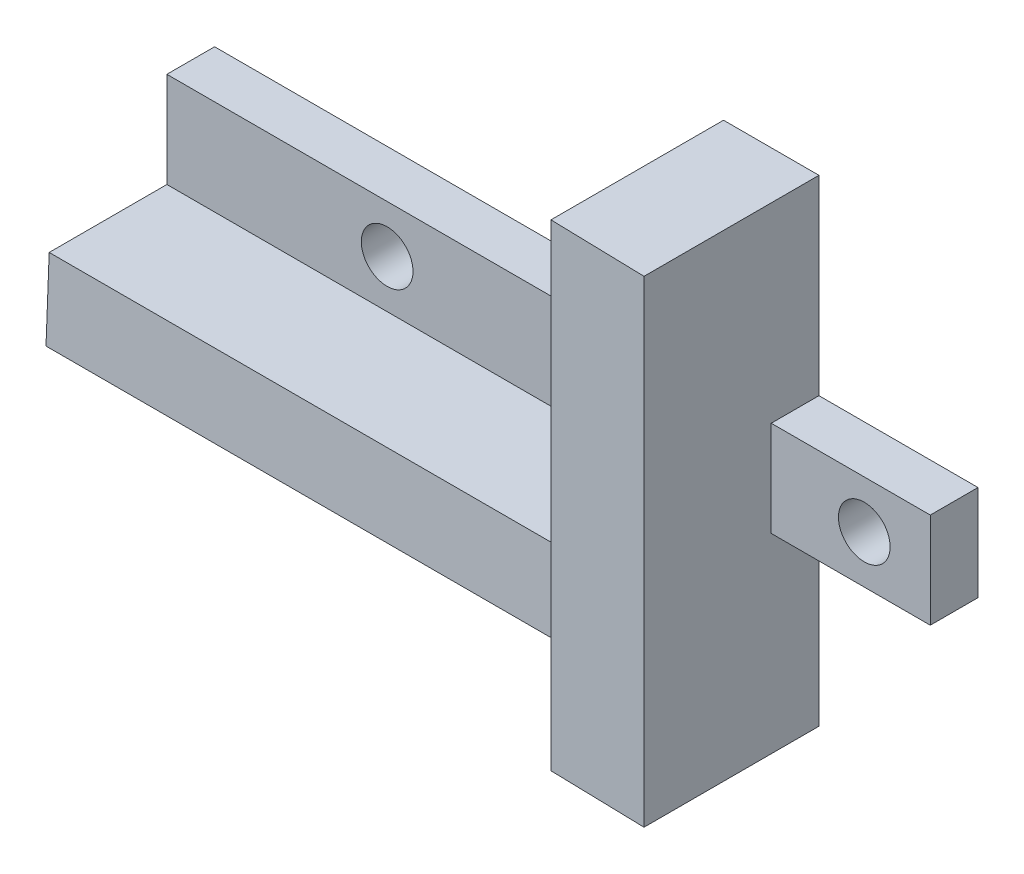
ISO-10303-21;
HEADER;
FILE_DESCRIPTION(('STEP AP214'),'2;1');
FILE_NAME('part.step','',(''),(''),'','','');
FILE_SCHEMA(('AUTOMOTIVE_DESIGN { 1 0 10303 214 1 1 1 1 }'));
ENDSEC;
DATA;
#1=APPLICATION_CONTEXT('core data for automotive mechanical design processes');
#2=APPLICATION_PROTOCOL_DEFINITION('international standard','automotive_design',2000,#1);
#3=PRODUCT_CONTEXT('',#1,'mechanical');
#4=PRODUCT('Part','Part','',(#3));
#5=PRODUCT_RELATED_PRODUCT_CATEGORY('part','',(#4));
#6=PRODUCT_DEFINITION_FORMATION('','',#4);
#7=PRODUCT_DEFINITION_CONTEXT('part definition',#1,'design');
#8=PRODUCT_DEFINITION('design','',#6,#7);
#9=PRODUCT_DEFINITION_SHAPE('','',#8);
#10=(LENGTH_UNIT() NAMED_UNIT(*) SI_UNIT(.MILLI.,.METRE.));
#11=(NAMED_UNIT(*) PLANE_ANGLE_UNIT() SI_UNIT($,.RADIAN.));
#12=(NAMED_UNIT(*) SI_UNIT($,.STERADIAN.) SOLID_ANGLE_UNIT());
#13=UNCERTAINTY_MEASURE_WITH_UNIT(LENGTH_MEASURE(1.E-05),#10,'distance_accuracy_value','');
#14=(GEOMETRIC_REPRESENTATION_CONTEXT(3) GLOBAL_UNCERTAINTY_ASSIGNED_CONTEXT((#13)) GLOBAL_UNIT_ASSIGNED_CONTEXT((#10,
#11,#12)) REPRESENTATION_CONTEXT('',''));
#15=CARTESIAN_POINT('',(0.,0.,0.));
#16=DIRECTION('',(0.,0.,1.));
#17=DIRECTION('',(1.,0.,0.));
#18=AXIS2_PLACEMENT_3D('',#15,#16,#17);
#19=CARTESIAN_POINT('',(0.,0.,3.));
#20=DIRECTION('',(0.,0.,1.));
#21=DIRECTION('',(1.,0.,0.));
#22=AXIS2_PLACEMENT_3D('',#19,#20,#21);
#23=PLANE('',#22);
#24=DIRECTION('',(0.,1.,0.));
#25=VECTOR('',#24,1.);
#26=CARTESIAN_POINT('',(38.,0.,3.));
#27=LINE('',#26,#25);
#28=CARTESIAN_POINT('',(38.,-6.,3.));
#29=VERTEX_POINT('',#28);
#30=CARTESIAN_POINT('',(38.,0.,3.));
#31=VERTEX_POINT('',#30);
#32=EDGE_CURVE('E121',#29,#31,#27,.T.);
#33=ORIENTED_EDGE('',*,*,#32,.F.);
#34=DIRECTION('',(1.,0.,0.));
#35=VECTOR('',#34,1.);
#36=CARTESIAN_POINT('',(48.,-6.,3.));
#37=LINE('',#36,#35);
#38=CARTESIAN_POINT('',(48.,-6.,3.));
#39=VERTEX_POINT('',#38);
#40=EDGE_CURVE('E167',#29,#39,#37,.T.);
#41=ORIENTED_EDGE('',*,*,#40,.T.);
#42=DIRECTION('',(0.,1.,0.));
#43=VECTOR('',#42,1.);
#44=CARTESIAN_POINT('',(48.,0.,3.));
#45=LINE('',#44,#43);
#46=CARTESIAN_POINT('',(48.,0.,3.));
#47=VERTEX_POINT('',#46);
#48=EDGE_CURVE('E124',#39,#47,#45,.T.);
#49=ORIENTED_EDGE('',*,*,#48,.T.);
#50=DIRECTION('',(-1.,0.,0.));
#51=VECTOR('',#50,1.);
#52=CARTESIAN_POINT('',(48.,0.,3.));
#53=LINE('',#52,#51);
#54=EDGE_CURVE('E117',#47,#31,#53,.T.);
#55=ORIENTED_EDGE('',*,*,#54,.T.);
#56=EDGE_LOOP('',(#33,#41,#49,#55));
#57=FACE_BOUND('',#56,.T.);
#58=CARTESIAN_POINT('',(43.85,-3.,3.));
#59=DIRECTION('',(0.,0.,1.));
#60=DIRECTION('',(1.,0.,0.));
#61=AXIS2_PLACEMENT_3D('',#58,#59,#60);
#62=CIRCLE('',#61,1.625);
#63=CARTESIAN_POINT('',(45.475,-3.,3.));
#64=VERTEX_POINT('',#63);
#65=EDGE_CURVE('E145',#64,#64,#62,.T.);
#66=ORIENTED_EDGE('',*,*,#65,.F.);
#67=EDGE_LOOP('',(#66));
#68=FACE_BOUND('',#67,.T.);
#69=ADVANCED_FACE('F32',(#57,#68),#23,.T.);
#70=CARTESIAN_POINT('',(0.,0.,3.));
#71=DIRECTION('',(1.,0.,0.));
#72=DIRECTION('',(0.,0.,-1.));
#73=AXIS2_PLACEMENT_3D('',#70,#71,#72);
#74=PLANE('',#73);
#75=DIRECTION('',(0.,0.,1.));
#76=VECTOR('',#75,1.);
#77=CARTESIAN_POINT('',(0.,-11.,0.));
#78=LINE('',#77,#76);
#79=CARTESIAN_POINT('',(0.,-11.,0.));
#80=VERTEX_POINT('',#79);
#81=CARTESIAN_POINT('',(0.,-11.,10.6));
#82=VERTEX_POINT('',#81);
#83=EDGE_CURVE('E263',#80,#82,#78,.T.);
#84=ORIENTED_EDGE('',*,*,#83,.T.);
#85=DIRECTION('',(0.,-0.999200958721789,0.0399680383488716));
#86=VECTOR('',#85,1.);
#87=CARTESIAN_POINT('',(0.,-11.,10.6));
#88=LINE('',#87,#86);
#89=CARTESIAN_POINT('',(0.,-6.,10.4));
#90=VERTEX_POINT('',#89);
#91=EDGE_CURVE('E247',#90,#82,#88,.T.);
#92=ORIENTED_EDGE('',*,*,#91,.F.);
#93=DIRECTION('',(0.,0.,1.));
#94=VECTOR('',#93,1.);
#95=CARTESIAN_POINT('',(0.,-6.,0.));
#96=LINE('',#95,#94);
#97=CARTESIAN_POINT('',(0.,-6.,3.));
#98=VERTEX_POINT('',#97);
#99=EDGE_CURVE('E266',#98,#90,#96,.T.);
#100=ORIENTED_EDGE('',*,*,#99,.F.);
#101=DIRECTION('',(0.,-1.,0.));
#102=VECTOR('',#101,1.);
#103=CARTESIAN_POINT('',(0.,0.,3.));
#104=LINE('',#103,#102);
#105=CARTESIAN_POINT('',(0.,0.,3.));
#106=VERTEX_POINT('',#105);
#107=EDGE_CURVE('E100',#106,#98,#104,.T.);
#108=ORIENTED_EDGE('',*,*,#107,.F.);
#109=DIRECTION('',(0.,0.,-1.));
#110=VECTOR('',#109,1.);
#111=CARTESIAN_POINT('',(0.,0.,3.));
#112=LINE('',#111,#110);
#113=CARTESIAN_POINT('',(0.,0.,0.));
#114=VERTEX_POINT('',#113);
#115=EDGE_CURVE('E171',#106,#114,#112,.T.);
#116=ORIENTED_EDGE('',*,*,#115,.T.);
#117=DIRECTION('',(0.,-1.,0.));
#118=VECTOR('',#117,1.);
#119=CARTESIAN_POINT('',(0.,0.,0.));
#120=LINE('',#119,#118);
#121=EDGE_CURVE('E158',#114,#80,#120,.T.);
#122=ORIENTED_EDGE('',*,*,#121,.T.);
#123=EDGE_LOOP('',(#84,#92,#100,#108,#116,#122));
#124=FACE_BOUND('',#123,.T.);
#125=ADVANCED_FACE('F34',(#124),#74,.F.);
#126=CARTESIAN_POINT('',(32.,-18.,3.));
#127=DIRECTION('',(0.,1.,0.));
#128=DIRECTION('',(0.,0.,1.));
#129=AXIS2_PLACEMENT_3D('',#126,#127,#128);
#130=PLANE('',#129);
#131=DIRECTION('',(0.,0.,-1.));
#132=VECTOR('',#131,1.);
#133=CARTESIAN_POINT('',(38.,-18.,3.));
#134=LINE('',#133,#132);
#135=CARTESIAN_POINT('',(38.,-18.,11.));
#136=VERTEX_POINT('',#135);
#137=CARTESIAN_POINT('',(38.,-18.,0.));
#138=VERTEX_POINT('',#137);
#139=EDGE_CURVE('E40',#136,#138,#134,.T.);
#140=ORIENTED_EDGE('',*,*,#139,.F.);
#141=DIRECTION('',(0.999687646408123,0.,0.0249921911602032));
#142=VECTOR('',#141,1.);
#143=CARTESIAN_POINT('',(32.,-18.,10.85));
#144=LINE('',#143,#142);
#145=CARTESIAN_POINT('',(32.,-18.,10.85));
#146=VERTEX_POINT('',#145);
#147=EDGE_CURVE('E240',#146,#136,#144,.T.);
#148=ORIENTED_EDGE('',*,*,#147,.F.);
#149=DIRECTION('',(0.,0.,-1.));
#150=VECTOR('',#149,1.);
#151=CARTESIAN_POINT('',(32.,-18.,3.));
#152=LINE('',#151,#150);
#153=CARTESIAN_POINT('',(32.,-18.,0.));
#154=VERTEX_POINT('',#153);
#155=EDGE_CURVE('E11',#146,#154,#152,.T.);
#156=ORIENTED_EDGE('',*,*,#155,.T.);
#157=DIRECTION('',(1.,0.,0.));
#158=VECTOR('',#157,1.);
#159=CARTESIAN_POINT('',(32.,-18.,0.));
#160=LINE('',#159,#158);
#161=EDGE_CURVE('E176',#154,#138,#160,.T.);
#162=ORIENTED_EDGE('',*,*,#161,.T.);
#163=EDGE_LOOP('',(#140,#148,#156,#162));
#164=FACE_BOUND('',#163,.T.);
#165=ADVANCED_FACE('F213',(#164),#130,.F.);
#166=CARTESIAN_POINT('',(48.,-6.,3.));
#167=DIRECTION('',(0.,1.,0.));
#168=DIRECTION('',(-1.,0.,0.));
#169=AXIS2_PLACEMENT_3D('',#166,#167,#168);
#170=PLANE('',#169);
#171=DIRECTION('',(1.,0.,0.));
#172=VECTOR('',#171,1.);
#173=CARTESIAN_POINT('',(48.,-6.,0.));
#174=LINE('',#173,#172);
#175=CARTESIAN_POINT('',(38.,-6.,0.));
#176=VERTEX_POINT('',#175);
#177=CARTESIAN_POINT('',(48.,-6.,0.));
#178=VERTEX_POINT('',#177);
#179=EDGE_CURVE('E181',#176,#178,#174,.T.);
#180=ORIENTED_EDGE('',*,*,#179,.T.);
#181=DIRECTION('',(0.,0.,-1.));
#182=VECTOR('',#181,1.);
#183=CARTESIAN_POINT('',(48.,-6.,3.));
#184=LINE('',#183,#182);
#185=EDGE_CURVE('E201',#39,#178,#184,.T.);
#186=ORIENTED_EDGE('',*,*,#185,.F.);
#187=ORIENTED_EDGE('',*,*,#40,.F.);
#188=DIRECTION('',(0.,0.,-1.));
#189=VECTOR('',#188,1.);
#190=CARTESIAN_POINT('',(38.,-6.,3.));
#191=LINE('',#190,#189);
#192=EDGE_CURVE('E143',#29,#176,#191,.T.);
#193=ORIENTED_EDGE('',*,*,#192,.T.);
#194=EDGE_LOOP('',(#180,#186,#187,#193));
#195=FACE_BOUND('',#194,.T.);
#196=ADVANCED_FACE('F222',(#195),#170,.F.);
#197=CARTESIAN_POINT('',(48.,0.,3.));
#198=DIRECTION('',(-1.,0.,0.));
#199=DIRECTION('',(0.,0.,1.));
#200=AXIS2_PLACEMENT_3D('',#197,#198,#199);
#201=PLANE('',#200);
#202=DIRECTION('',(0.,1.,0.));
#203=VECTOR('',#202,1.);
#204=CARTESIAN_POINT('',(48.,0.,0.));
#205=LINE('',#204,#203);
#206=CARTESIAN_POINT('',(48.,0.,0.));
#207=VERTEX_POINT('',#206);
#208=EDGE_CURVE('E183',#178,#207,#205,.T.);
#209=ORIENTED_EDGE('',*,*,#208,.T.);
#210=DIRECTION('',(0.,0.,-1.));
#211=VECTOR('',#210,1.);
#212=CARTESIAN_POINT('',(48.,0.,3.));
#213=LINE('',#212,#211);
#214=EDGE_CURVE('E137',#47,#207,#213,.T.);
#215=ORIENTED_EDGE('',*,*,#214,.F.);
#216=ORIENTED_EDGE('',*,*,#48,.F.);
#217=ORIENTED_EDGE('',*,*,#185,.T.);
#218=EDGE_LOOP('',(#209,#215,#216,#217));
#219=FACE_BOUND('',#218,.T.);
#220=ADVANCED_FACE('F224',(#219),#201,.F.);
#221=CARTESIAN_POINT('',(48.,0.,3.));
#222=DIRECTION('',(0.,-1.,0.));
#223=DIRECTION('',(1.,0.,0.));
#224=AXIS2_PLACEMENT_3D('',#221,#222,#223);
#225=PLANE('',#224);
#226=DIRECTION('',(-1.,0.,0.));
#227=VECTOR('',#226,1.);
#228=CARTESIAN_POINT('',(48.,0.,0.));
#229=LINE('',#228,#227);
#230=CARTESIAN_POINT('',(38.,0.,0.));
#231=VERTEX_POINT('',#230);
#232=EDGE_CURVE('E133',#207,#231,#229,.T.);
#233=ORIENTED_EDGE('',*,*,#232,.T.);
#234=DIRECTION('',(0.,0.,-1.));
#235=VECTOR('',#234,1.);
#236=CARTESIAN_POINT('',(38.,0.,3.));
#237=LINE('',#236,#235);
#238=EDGE_CURVE('E130',#31,#231,#237,.T.);
#239=ORIENTED_EDGE('',*,*,#238,.F.);
#240=ORIENTED_EDGE('',*,*,#54,.F.);
#241=ORIENTED_EDGE('',*,*,#214,.T.);
#242=EDGE_LOOP('',(#233,#239,#240,#241));
#243=FACE_BOUND('',#242,.T.);
#244=ADVANCED_FACE('F131',(#243),#225,.F.);
#245=CARTESIAN_POINT('',(38.,12.,3.));
#246=DIRECTION('',(-1.,0.,0.));
#247=DIRECTION('',(0.,0.,1.));
#248=AXIS2_PLACEMENT_3D('',#245,#246,#247);
#249=PLANE('',#248);
#250=DIRECTION('',(0.,0.,-1.));
#251=VECTOR('',#250,1.);
#252=CARTESIAN_POINT('',(38.,12.,3.));
#253=LINE('',#252,#251);
#254=CARTESIAN_POINT('',(38.,12.,11.));
#255=VERTEX_POINT('',#254);
#256=CARTESIAN_POINT('',(38.,12.,0.));
#257=VERTEX_POINT('',#256);
#258=EDGE_CURVE('E138',#255,#257,#253,.T.);
#259=ORIENTED_EDGE('',*,*,#258,.F.);
#260=DIRECTION('',(0.,1.,0.));
#261=VECTOR('',#260,1.);
#262=CARTESIAN_POINT('',(38.,12.,11.));
#263=LINE('',#262,#261);
#264=EDGE_CURVE('E209',#136,#255,#263,.T.);
#265=ORIENTED_EDGE('',*,*,#264,.F.);
#266=ORIENTED_EDGE('',*,*,#139,.T.);
#267=DIRECTION('',(0.,1.,0.));
#268=VECTOR('',#267,1.);
#269=CARTESIAN_POINT('',(38.,-6.,0.));
#270=LINE('',#269,#268);
#271=EDGE_CURVE('E179',#138,#176,#270,.T.);
#272=ORIENTED_EDGE('',*,*,#271,.T.);
#273=ORIENTED_EDGE('',*,*,#192,.F.);
#274=ORIENTED_EDGE('',*,*,#32,.T.);
#275=ORIENTED_EDGE('',*,*,#238,.T.);
#276=DIRECTION('',(0.,1.,0.));
#277=VECTOR('',#276,1.);
#278=CARTESIAN_POINT('',(38.,12.,0.));
#279=LINE('',#278,#277);
#280=EDGE_CURVE('E186',#231,#257,#279,.T.);
#281=ORIENTED_EDGE('',*,*,#280,.T.);
#282=EDGE_LOOP('',(#259,#265,#266,#272,#273,#274,#275,#281));
#283=FACE_BOUND('',#282,.T.);
#284=ADVANCED_FACE('F141',(#283),#249,.F.);
#285=CARTESIAN_POINT('',(32.,12.,3.));
#286=DIRECTION('',(0.,-1.,0.));
#287=DIRECTION('',(1.,0.,0.));
#288=AXIS2_PLACEMENT_3D('',#285,#286,#287);
#289=PLANE('',#288);
#290=DIRECTION('',(0.,0.,-1.));
#291=VECTOR('',#290,1.);
#292=CARTESIAN_POINT('',(32.,12.,3.));
#293=LINE('',#292,#291);
#294=CARTESIAN_POINT('',(32.,12.,10.85));
#295=VERTEX_POINT('',#294);
#296=CARTESIAN_POINT('',(32.,12.,0.));
#297=VERTEX_POINT('',#296);
#298=EDGE_CURVE('E197',#295,#297,#293,.T.);
#299=ORIENTED_EDGE('',*,*,#298,.F.);
#300=DIRECTION('',(0.999687646408123,0.,0.0249921911602032));
#301=VECTOR('',#300,1.);
#302=CARTESIAN_POINT('',(32.,12.,10.85));
#303=LINE('',#302,#301);
#304=EDGE_CURVE('E235',#295,#255,#303,.T.);
#305=ORIENTED_EDGE('',*,*,#304,.T.);
#306=ORIENTED_EDGE('',*,*,#258,.T.);
#307=DIRECTION('',(-1.,0.,0.));
#308=VECTOR('',#307,1.);
#309=CARTESIAN_POINT('',(32.,12.,0.));
#310=LINE('',#309,#308);
#311=EDGE_CURVE('E188',#257,#297,#310,.T.);
#312=ORIENTED_EDGE('',*,*,#311,.T.);
#313=EDGE_LOOP('',(#299,#305,#306,#312));
#314=FACE_BOUND('',#313,.T.);
#315=ADVANCED_FACE('F233',(#314),#289,.F.);
#316=CARTESIAN_POINT('',(32.,12.,3.));
#317=DIRECTION('',(1.,0.,0.));
#318=DIRECTION('',(0.,0.,-1.));
#319=AXIS2_PLACEMENT_3D('',#316,#317,#318);
#320=PLANE('',#319);
#321=ORIENTED_EDGE('',*,*,#155,.F.);
#322=DIRECTION('',(0.,-1.,0.));
#323=VECTOR('',#322,1.);
#324=CARTESIAN_POINT('',(32.,12.,10.85));
#325=LINE('',#324,#323);
#326=EDGE_CURVE('E239',#295,#146,#325,.T.);
#327=ORIENTED_EDGE('',*,*,#326,.F.);
#328=ORIENTED_EDGE('',*,*,#298,.T.);
#329=DIRECTION('',(0.,-1.,0.));
#330=VECTOR('',#329,1.);
#331=CARTESIAN_POINT('',(32.,12.,0.));
#332=LINE('',#331,#330);
#333=CARTESIAN_POINT('',(32.,0.,0.));
#334=VERTEX_POINT('',#333);
#335=EDGE_CURVE('E191',#297,#334,#332,.T.);
#336=ORIENTED_EDGE('',*,*,#335,.T.);
#337=DIRECTION('',(0.,0.,-1.));
#338=VECTOR('',#337,1.);
#339=CARTESIAN_POINT('',(32.,0.,3.));
#340=LINE('',#339,#338);
#341=CARTESIAN_POINT('',(32.,0.,3.));
#342=VERTEX_POINT('',#341);
#343=EDGE_CURVE('E195',#342,#334,#340,.T.);
#344=ORIENTED_EDGE('',*,*,#343,.F.);
#345=DIRECTION('',(0.,-1.,0.));
#346=VECTOR('',#345,1.);
#347=CARTESIAN_POINT('',(32.,0.,3.));
#348=LINE('',#347,#346);
#349=CARTESIAN_POINT('',(32.,-6.,3.));
#350=VERTEX_POINT('',#349);
#351=EDGE_CURVE('E146',#342,#350,#348,.T.);
#352=ORIENTED_EDGE('',*,*,#351,.T.);
#353=DIRECTION('',(0.,0.,1.));
#354=VECTOR('',#353,1.);
#355=CARTESIAN_POINT('',(32.,-6.,0.));
#356=LINE('',#355,#354);
#357=CARTESIAN_POINT('',(32.,-6.,10.4));
#358=VERTEX_POINT('',#357);
#359=EDGE_CURVE('E261',#350,#358,#356,.T.);
#360=ORIENTED_EDGE('',*,*,#359,.T.);
#361=DIRECTION('',(0.,-0.999200958721789,0.0399680383488716));
#362=VECTOR('',#361,1.);
#363=CARTESIAN_POINT('',(32.,-11.,10.6));
#364=LINE('',#363,#362);
#365=CARTESIAN_POINT('',(32.,-11.,10.6));
#366=VERTEX_POINT('',#365);
#367=EDGE_CURVE('E248',#358,#366,#364,.T.);
#368=ORIENTED_EDGE('',*,*,#367,.T.);
#369=DIRECTION('',(0.,0.,1.));
#370=VECTOR('',#369,1.);
#371=CARTESIAN_POINT('',(32.,-11.,0.));
#372=LINE('',#371,#370);
#373=CARTESIAN_POINT('',(32.,-11.,0.));
#374=VERTEX_POINT('',#373);
#375=EDGE_CURVE('E47',#374,#366,#372,.T.);
#376=ORIENTED_EDGE('',*,*,#375,.F.);
#377=DIRECTION('',(0.,-1.,0.));
#378=VECTOR('',#377,1.);
#379=CARTESIAN_POINT('',(32.,-6.,0.));
#380=LINE('',#379,#378);
#381=EDGE_CURVE('E174',#374,#154,#380,.T.);
#382=ORIENTED_EDGE('',*,*,#381,.T.);
#383=EDGE_LOOP('',(#321,#327,#328,#336,#344,#352,#360,#368,#376,#382));
#384=FACE_BOUND('',#383,.T.);
#385=ADVANCED_FACE('F271',(#384),#320,.F.);
#386=CARTESIAN_POINT('',(0.,0.,3.));
#387=DIRECTION('',(0.,-1.,0.));
#388=DIRECTION('',(0.,0.,-1.));
#389=AXIS2_PLACEMENT_3D('',#386,#387,#388);
#390=PLANE('',#389);
#391=DIRECTION('',(-1.,0.,0.));
#392=VECTOR('',#391,1.);
#393=CARTESIAN_POINT('',(0.,0.,0.));
#394=LINE('',#393,#392);
#395=EDGE_CURVE('E94',#334,#114,#394,.T.);
#396=ORIENTED_EDGE('',*,*,#395,.T.);
#397=ORIENTED_EDGE('',*,*,#115,.F.);
#398=DIRECTION('',(-1.,0.,0.));
#399=VECTOR('',#398,1.);
#400=CARTESIAN_POINT('',(0.,0.,3.));
#401=LINE('',#400,#399);
#402=EDGE_CURVE('E56',#342,#106,#401,.T.);
#403=ORIENTED_EDGE('',*,*,#402,.F.);
#404=ORIENTED_EDGE('',*,*,#343,.T.);
#405=EDGE_LOOP('',(#396,#397,#403,#404));
#406=FACE_BOUND('',#405,.T.);
#407=ADVANCED_FACE('F315',(#406),#390,.F.);
#408=ORIENTED_EDGE('',*,*,#351,.F.);
#409=ORIENTED_EDGE('',*,*,#402,.T.);
#410=ORIENTED_EDGE('',*,*,#107,.T.);
#411=DIRECTION('',(1.,0.,0.));
#412=VECTOR('',#411,1.);
#413=CARTESIAN_POINT('',(0.,-6.,3.));
#414=LINE('',#413,#412);
#415=EDGE_CURVE('E165',#98,#350,#414,.T.);
#416=ORIENTED_EDGE('',*,*,#415,.T.);
#417=EDGE_LOOP('',(#408,#409,#410,#416));
#418=FACE_BOUND('',#417,.T.);
#419=CARTESIAN_POINT('',(13.85,-3.,3.));
#420=DIRECTION('',(0.,0.,1.));
#421=DIRECTION('',(1.,0.,0.));
#422=AXIS2_PLACEMENT_3D('',#419,#420,#421);
#423=CIRCLE('',#422,1.625);
#424=CARTESIAN_POINT('',(15.475,-3.,3.));
#425=VERTEX_POINT('',#424);
#426=EDGE_CURVE('E159',#425,#425,#423,.T.);
#427=ORIENTED_EDGE('',*,*,#426,.F.);
#428=EDGE_LOOP('',(#427));
#429=FACE_BOUND('',#428,.T.);
#430=ADVANCED_FACE('F307',(#418,#429),#23,.T.);
#431=CARTESIAN_POINT('',(0.,0.,0.));
#432=DIRECTION('',(0.,0.,1.));
#433=DIRECTION('',(1.,0.,0.));
#434=AXIS2_PLACEMENT_3D('',#431,#432,#433);
#435=PLANE('',#434);
#436=ORIENTED_EDGE('',*,*,#381,.F.);
#437=DIRECTION('',(1.,0.,0.));
#438=VECTOR('',#437,1.);
#439=CARTESIAN_POINT('',(32.,-11.,0.));
#440=LINE('',#439,#438);
#441=EDGE_CURVE('E256',#80,#374,#440,.T.);
#442=ORIENTED_EDGE('',*,*,#441,.F.);
#443=ORIENTED_EDGE('',*,*,#121,.F.);
#444=ORIENTED_EDGE('',*,*,#395,.F.);
#445=ORIENTED_EDGE('',*,*,#335,.F.);
#446=ORIENTED_EDGE('',*,*,#311,.F.);
#447=ORIENTED_EDGE('',*,*,#280,.F.);
#448=ORIENTED_EDGE('',*,*,#232,.F.);
#449=ORIENTED_EDGE('',*,*,#208,.F.);
#450=ORIENTED_EDGE('',*,*,#179,.F.);
#451=ORIENTED_EDGE('',*,*,#271,.F.);
#452=ORIENTED_EDGE('',*,*,#161,.F.);
#453=EDGE_LOOP('',(#436,#442,#443,#444,#445,#446,#447,#448,#449,#450,#451,#452));
#454=FACE_BOUND('',#453,.T.);
#455=CARTESIAN_POINT('',(13.85,-3.,0.));
#456=DIRECTION('',(0.,0.,1.));
#457=DIRECTION('',(1.,0.,0.));
#458=AXIS2_PLACEMENT_3D('',#455,#456,#457);
#459=CIRCLE('',#458,1.625);
#460=CARTESIAN_POINT('',(15.475,-3.,0.));
#461=VERTEX_POINT('',#460);
#462=EDGE_CURVE('E155',#461,#461,#459,.T.);
#463=ORIENTED_EDGE('',*,*,#462,.T.);
#464=EDGE_LOOP('',(#463));
#465=FACE_BOUND('',#464,.T.);
#466=CARTESIAN_POINT('',(43.85,-3.,0.));
#467=DIRECTION('',(0.,0.,1.));
#468=DIRECTION('',(1.,0.,0.));
#469=AXIS2_PLACEMENT_3D('',#466,#467,#468);
#470=CIRCLE('',#469,1.625);
#471=CARTESIAN_POINT('',(45.475,-3.,0.));
#472=VERTEX_POINT('',#471);
#473=EDGE_CURVE('E149',#472,#472,#470,.T.);
#474=ORIENTED_EDGE('',*,*,#473,.T.);
#475=EDGE_LOOP('',(#474));
#476=FACE_BOUND('',#475,.T.);
#477=ADVANCED_FACE('F217',(#454,#465,#476),#435,.F.);
#478=CARTESIAN_POINT('',(43.85,-3.,0.));
#479=DIRECTION('',(0.,0.,1.));
#480=DIRECTION('',(1.,0.,0.));
#481=AXIS2_PLACEMENT_3D('',#478,#479,#480);
#482=CYLINDRICAL_SURFACE('',#481,1.625);
#483=ORIENTED_EDGE('',*,*,#473,.F.);
#484=EDGE_LOOP('',(#483));
#485=FACE_BOUND('',#484,.T.);
#486=ORIENTED_EDGE('',*,*,#65,.T.);
#487=EDGE_LOOP('',(#486));
#488=FACE_BOUND('',#487,.T.);
#489=ADVANCED_FACE('F320',(#485,#488),#482,.F.);
#490=CARTESIAN_POINT('',(13.85,-3.,0.));
#491=DIRECTION('',(0.,0.,1.));
#492=DIRECTION('',(1.,0.,0.));
#493=AXIS2_PLACEMENT_3D('',#490,#491,#492);
#494=CYLINDRICAL_SURFACE('',#493,1.625);
#495=ORIENTED_EDGE('',*,*,#462,.F.);
#496=EDGE_LOOP('',(#495));
#497=FACE_BOUND('',#496,.T.);
#498=ORIENTED_EDGE('',*,*,#426,.T.);
#499=EDGE_LOOP('',(#498));
#500=FACE_BOUND('',#499,.T.);
#501=ADVANCED_FACE('F325',(#497,#500),#494,.F.);
#502=CARTESIAN_POINT('',(32.,-11.,0.));
#503=DIRECTION('',(0.,-1.,0.));
#504=DIRECTION('',(1.,0.,0.));
#505=AXIS2_PLACEMENT_3D('',#502,#503,#504);
#506=PLANE('',#505);
#507=DIRECTION('',(-1.,0.,0.));
#508=VECTOR('',#507,1.);
#509=CARTESIAN_POINT('',(32.,-11.,10.6));
#510=LINE('',#509,#508);
#511=EDGE_CURVE('E253',#366,#82,#510,.T.);
#512=ORIENTED_EDGE('',*,*,#511,.T.);
#513=ORIENTED_EDGE('',*,*,#83,.F.);
#514=ORIENTED_EDGE('',*,*,#441,.T.);
#515=ORIENTED_EDGE('',*,*,#375,.T.);
#516=EDGE_LOOP('',(#512,#513,#514,#515));
#517=FACE_BOUND('',#516,.T.);
#518=ADVANCED_FACE('F292',(#517),#506,.T.);
#519=CARTESIAN_POINT('',(32.,-6.,0.));
#520=DIRECTION('',(0.,1.,0.));
#521=DIRECTION('',(0.,0.,1.));
#522=AXIS2_PLACEMENT_3D('',#519,#520,#521);
#523=PLANE('',#522);
#524=DIRECTION('',(-1.,0.,0.));
#525=VECTOR('',#524,1.);
#526=CARTESIAN_POINT('',(32.,-6.,10.4));
#527=LINE('',#526,#525);
#528=EDGE_CURVE('E250',#358,#90,#527,.T.);
#529=ORIENTED_EDGE('',*,*,#528,.F.);
#530=ORIENTED_EDGE('',*,*,#359,.F.);
#531=ORIENTED_EDGE('',*,*,#415,.F.);
#532=ORIENTED_EDGE('',*,*,#99,.T.);
#533=EDGE_LOOP('',(#529,#530,#531,#532));
#534=FACE_BOUND('',#533,.T.);
#535=ADVANCED_FACE('F279',(#534),#523,.T.);
#536=CARTESIAN_POINT('',(32.,-11.,10.6));
#537=DIRECTION('',(0.,-0.0399680383488716,-0.999200958721789));
#538=DIRECTION('',(0.,0.999200958721789,-0.0399680383488716));
#539=AXIS2_PLACEMENT_3D('',#536,#537,#538);
#540=PLANE('',#539);
#541=ORIENTED_EDGE('',*,*,#91,.T.);
#542=ORIENTED_EDGE('',*,*,#511,.F.);
#543=ORIENTED_EDGE('',*,*,#367,.F.);
#544=ORIENTED_EDGE('',*,*,#528,.T.);
#545=EDGE_LOOP('',(#541,#542,#543,#544));
#546=FACE_BOUND('',#545,.T.);
#547=ADVANCED_FACE('F284',(#546),#540,.F.);
#548=CARTESIAN_POINT('',(32.,12.,10.85));
#549=DIRECTION('',(0.0249921911602032,0.,-0.999687646408123));
#550=DIRECTION('',(-0.999687646408123,0.,-0.0249921911602032));
#551=AXIS2_PLACEMENT_3D('',#548,#549,#550);
#552=PLANE('',#551);
#553=ORIENTED_EDGE('',*,*,#147,.T.);
#554=ORIENTED_EDGE('',*,*,#264,.T.);
#555=ORIENTED_EDGE('',*,*,#304,.F.);
#556=ORIENTED_EDGE('',*,*,#326,.T.);
#557=EDGE_LOOP('',(#553,#554,#555,#556));
#558=FACE_BOUND('',#557,.T.);
#559=ADVANCED_FACE('F298',(#558),#552,.F.);
#560=CLOSED_SHELL('',(#69,#125,#165,#196,#220,#244,#284,#315,#385,#407,#430,#477,#489,#501,#518,
#535,#547,#559));
#561=MANIFOLD_SOLID_BREP('B2',#560);
#562=ADVANCED_BREP_SHAPE_REPRESENTATION('',(#18,#561),#14);
#563=SHAPE_DEFINITION_REPRESENTATION(#9,#562);
ENDSEC;
END-ISO-10303-21;
